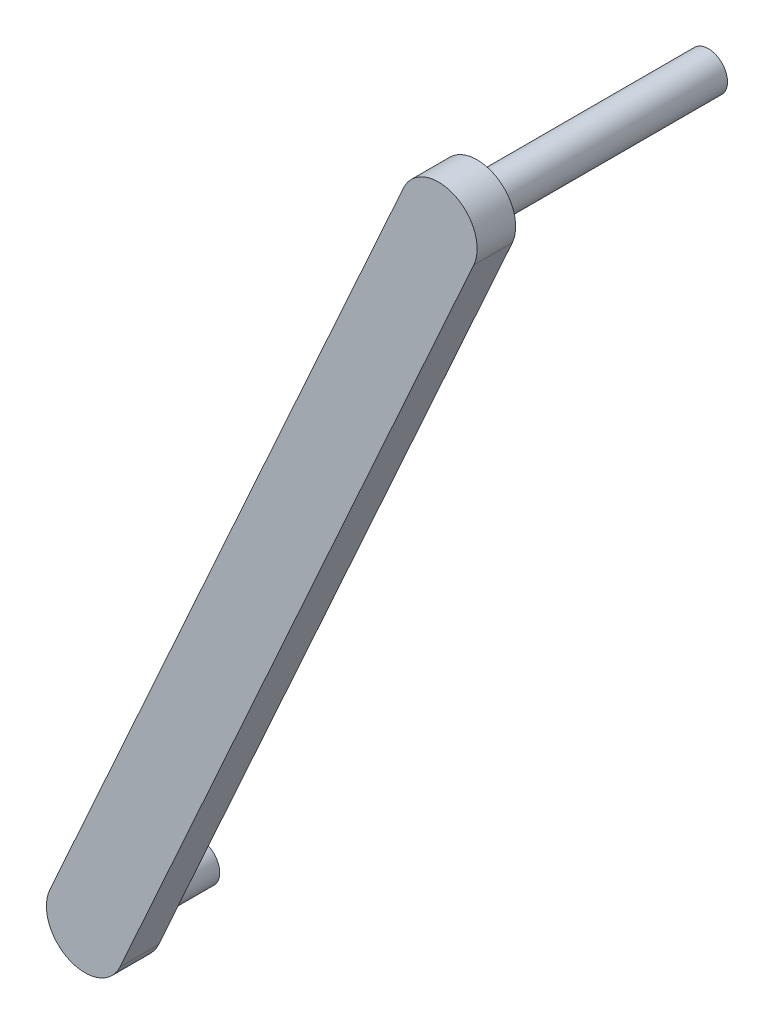
ISO-10303-21;
HEADER;
FILE_DESCRIPTION(('STEP AP214'),'2;1');
FILE_NAME('part.step','',(''),(''),'','','');
FILE_SCHEMA(('AUTOMOTIVE_DESIGN { 1 0 10303 214 1 1 1 1 }'));
ENDSEC;
DATA;
#1=APPLICATION_CONTEXT('core data for automotive mechanical design processes');
#2=APPLICATION_PROTOCOL_DEFINITION('international standard','automotive_design',2000,#1);
#3=PRODUCT_CONTEXT('',#1,'mechanical');
#4=PRODUCT('Part','Part','',(#3));
#5=PRODUCT_RELATED_PRODUCT_CATEGORY('part','',(#4));
#6=PRODUCT_DEFINITION_FORMATION('','',#4);
#7=PRODUCT_DEFINITION_CONTEXT('part definition',#1,'design');
#8=PRODUCT_DEFINITION('design','',#6,#7);
#9=PRODUCT_DEFINITION_SHAPE('','',#8);
#10=(LENGTH_UNIT() NAMED_UNIT(*) SI_UNIT(.MILLI.,.METRE.));
#11=(NAMED_UNIT(*) PLANE_ANGLE_UNIT() SI_UNIT($,.RADIAN.));
#12=(NAMED_UNIT(*) SI_UNIT($,.STERADIAN.) SOLID_ANGLE_UNIT());
#13=UNCERTAINTY_MEASURE_WITH_UNIT(LENGTH_MEASURE(1.E-05),#10,'distance_accuracy_value','');
#14=(GEOMETRIC_REPRESENTATION_CONTEXT(3) GLOBAL_UNCERTAINTY_ASSIGNED_CONTEXT((#13)) GLOBAL_UNIT_ASSIGNED_CONTEXT((#10,
#11,#12)) REPRESENTATION_CONTEXT('',''));
#15=CARTESIAN_POINT('',(0.,0.,0.));
#16=DIRECTION('',(0.,0.,1.));
#17=DIRECTION('',(1.,0.,0.));
#18=AXIS2_PLACEMENT_3D('',#15,#16,#17);
#19=CARTESIAN_POINT('',(0.924716253549064,-18.2644433496141,16.8753490196646));
#20=DIRECTION('',(0.,0.,-1.));
#21=DIRECTION('',(-1.,0.,0.));
#22=AXIS2_PLACEMENT_3D('',#19,#20,#21);
#23=CYLINDRICAL_SURFACE('',#22,2.);
#24=CARTESIAN_POINT('',(0.924716253549064,-18.2644433496141,14.8753490196646));
#25=DIRECTION('',(0.,0.,1.));
#26=DIRECTION('',(1.,0.,0.));
#27=AXIS2_PLACEMENT_3D('',#24,#25,#26);
#28=CIRCLE('',#27,2.);
#29=CARTESIAN_POINT('',(2.74802609914753,-19.0863564879345,14.8753490196646));
#30=VERTEX_POINT('',#29);
#31=CARTESIAN_POINT('',(-0.898593592049403,-17.4425302112937,14.8753490196646));
#32=VERTEX_POINT('',#31);
#33=EDGE_CURVE('E98',#30,#32,#28,.T.);
#34=ORIENTED_EDGE('',*,*,#33,.T.);
#35=DIRECTION('',(0.,0.,-1.));
#36=VECTOR('',#35,1.);
#37=CARTESIAN_POINT('',(-0.898593592049403,-17.4425302112937,16.8753490196646));
#38=LINE('',#37,#36);
#39=CARTESIAN_POINT('',(-0.898593592049403,-17.4425302112937,16.8753490196646));
#40=VERTEX_POINT('',#39);
#41=EDGE_CURVE('E11',#40,#32,#38,.T.);
#42=ORIENTED_EDGE('',*,*,#41,.F.);
#43=CARTESIAN_POINT('',(0.924716253549064,-18.2644433496141,16.8753490196646));
#44=DIRECTION('',(0.,0.,1.));
#45=DIRECTION('',(1.,0.,0.));
#46=AXIS2_PLACEMENT_3D('',#43,#44,#45);
#47=CIRCLE('',#46,2.);
#48=CARTESIAN_POINT('',(2.74802609914753,-19.0863564879345,16.8753490196646));
#49=VERTEX_POINT('',#48);
#50=EDGE_CURVE('E84',#49,#40,#47,.T.);
#51=ORIENTED_EDGE('',*,*,#50,.F.);
#52=DIRECTION('',(0.,0.,-1.));
#53=VECTOR('',#52,1.);
#54=CARTESIAN_POINT('',(2.74802609914753,-19.0863564879345,16.8753490196646));
#55=LINE('',#54,#53);
#56=EDGE_CURVE('E51',#49,#30,#55,.T.);
#57=ORIENTED_EDGE('',*,*,#56,.T.);
#58=EDGE_LOOP('',(#34,#42,#51,#57));
#59=FACE_BOUND('',#58,.T.);
#60=ADVANCED_FACE('F35',(#59),#23,.T.);
#61=CARTESIAN_POINT('',(-0.898593592049403,-17.4425302112937,16.8753490196646));
#62=DIRECTION('',(0.911654922799236,-0.410956569160197,0.));
#63=DIRECTION('',(0.410956569160197,0.911654922799236,0.));
#64=AXIS2_PLACEMENT_3D('',#61,#62,#63);
#65=PLANE('',#64);
#66=DIRECTION('',(-0.410956569160197,-0.911654922799236,0.));
#67=VECTOR('',#66,1.);
#68=CARTESIAN_POINT('',(-0.898593592049403,-17.4425302112937,14.8753490196646));
#69=LINE('',#68,#67);
#70=CARTESIAN_POINT('',(-19.2612829459463,-58.1778229443502,14.8753490196646));
#71=VERTEX_POINT('',#70);
#72=EDGE_CURVE('E89',#32,#71,#69,.T.);
#73=ORIENTED_EDGE('',*,*,#72,.T.);
#74=DIRECTION('',(0.,0.,-1.));
#75=VECTOR('',#74,1.);
#76=CARTESIAN_POINT('',(-19.2612829459463,-58.1778229443502,16.8753490196646));
#77=LINE('',#76,#75);
#78=CARTESIAN_POINT('',(-19.2612829459463,-58.1778229443502,16.8753490196646));
#79=VERTEX_POINT('',#78);
#80=EDGE_CURVE('E43',#79,#71,#77,.T.);
#81=ORIENTED_EDGE('',*,*,#80,.F.);
#82=DIRECTION('',(-0.410956569160197,-0.911654922799236,0.));
#83=VECTOR('',#82,1.);
#84=CARTESIAN_POINT('',(-0.898593592049403,-17.4425302112937,16.8753490196646));
#85=LINE('',#84,#83);
#86=EDGE_CURVE('E77',#40,#79,#85,.T.);
#87=ORIENTED_EDGE('',*,*,#86,.F.);
#88=ORIENTED_EDGE('',*,*,#41,.T.);
#89=EDGE_LOOP('',(#73,#81,#87,#88));
#90=FACE_BOUND('',#89,.T.);
#91=ADVANCED_FACE('F88',(#90),#65,.F.);
#92=CARTESIAN_POINT('',(-17.4379731003478,-58.9997360826706,16.8753490196646));
#93=DIRECTION('',(0.,0.,-1.));
#94=DIRECTION('',(-1.,0.,0.));
#95=AXIS2_PLACEMENT_3D('',#92,#93,#94);
#96=CYLINDRICAL_SURFACE('',#95,2.);
#97=CARTESIAN_POINT('',(-17.4379731003478,-58.9997360826706,14.8753490196646));
#98=DIRECTION('',(0.,0.,1.));
#99=DIRECTION('',(1.,0.,0.));
#100=AXIS2_PLACEMENT_3D('',#97,#98,#99);
#101=CIRCLE('',#100,2.);
#102=CARTESIAN_POINT('',(-15.6146632547493,-59.8216492209909,14.8753490196646));
#103=VERTEX_POINT('',#102);
#104=EDGE_CURVE('E102',#71,#103,#101,.T.);
#105=ORIENTED_EDGE('',*,*,#104,.T.);
#106=DIRECTION('',(0.,0.,-1.));
#107=VECTOR('',#106,1.);
#108=CARTESIAN_POINT('',(-15.6146632547493,-59.8216492209909,16.8753490196646));
#109=LINE('',#108,#107);
#110=CARTESIAN_POINT('',(-15.6146632547493,-59.8216492209909,16.8753490196646));
#111=VERTEX_POINT('',#110);
#112=EDGE_CURVE('E66',#111,#103,#109,.T.);
#113=ORIENTED_EDGE('',*,*,#112,.F.);
#114=CARTESIAN_POINT('',(-17.4379731003478,-58.9997360826706,16.8753490196646));
#115=DIRECTION('',(0.,0.,1.));
#116=DIRECTION('',(1.,0.,0.));
#117=AXIS2_PLACEMENT_3D('',#114,#115,#116);
#118=CIRCLE('',#117,2.);
#119=EDGE_CURVE('E83',#79,#111,#118,.T.);
#120=ORIENTED_EDGE('',*,*,#119,.F.);
#121=ORIENTED_EDGE('',*,*,#80,.T.);
#122=EDGE_LOOP('',(#105,#113,#120,#121));
#123=FACE_BOUND('',#122,.T.);
#124=ADVANCED_FACE('F92',(#123),#96,.T.);
#125=CARTESIAN_POINT('',(2.74802609914753,-19.0863564879345,16.8753490196646));
#126=DIRECTION('',(0.911654922799236,-0.410956569160197,0.));
#127=DIRECTION('',(0.410956569160197,0.911654922799236,0.));
#128=AXIS2_PLACEMENT_3D('',#125,#126,#127);
#129=PLANE('',#128);
#130=DIRECTION('',(-0.410956569160197,-0.911654922799236,0.));
#131=VECTOR('',#130,1.);
#132=CARTESIAN_POINT('',(2.74802609914753,-19.0863564879345,14.8753490196646));
#133=LINE('',#132,#131);
#134=EDGE_CURVE('E104',#30,#103,#133,.T.);
#135=ORIENTED_EDGE('',*,*,#134,.F.);
#136=ORIENTED_EDGE('',*,*,#56,.F.);
#137=DIRECTION('',(-0.410956569160197,-0.911654922799236,0.));
#138=VECTOR('',#137,1.);
#139=CARTESIAN_POINT('',(2.74802609914753,-19.0863564879345,16.8753490196646));
#140=LINE('',#139,#138);
#141=EDGE_CURVE('E93',#49,#111,#140,.T.);
#142=ORIENTED_EDGE('',*,*,#141,.T.);
#143=ORIENTED_EDGE('',*,*,#112,.T.);
#144=EDGE_LOOP('',(#135,#136,#142,#143));
#145=FACE_BOUND('',#144,.T.);
#146=ADVANCED_FACE('F138',(#145),#129,.T.);
#147=CARTESIAN_POINT('',(0.924716253549064,-18.2644433496141,16.8753490196646));
#148=DIRECTION('',(0.,0.,1.));
#149=DIRECTION('',(1.,0.,0.));
#150=AXIS2_PLACEMENT_3D('',#147,#148,#149);
#151=PLANE('',#150);
#152=ORIENTED_EDGE('',*,*,#50,.T.);
#153=ORIENTED_EDGE('',*,*,#86,.T.);
#154=ORIENTED_EDGE('',*,*,#119,.T.);
#155=ORIENTED_EDGE('',*,*,#141,.F.);
#156=EDGE_LOOP('',(#152,#153,#154,#155));
#157=FACE_BOUND('',#156,.T.);
#158=ADVANCED_FACE('F80',(#157),#151,.T.);
#159=CARTESIAN_POINT('',(0.924716253549064,-18.2644433496141,14.8753490196646));
#160=DIRECTION('',(0.,0.,1.));
#161=DIRECTION('',(1.,0.,0.));
#162=AXIS2_PLACEMENT_3D('',#159,#160,#161);
#163=PLANE('',#162);
#164=CARTESIAN_POINT('',(0.924716253549064,-18.2644433496141,14.8753490196646));
#165=DIRECTION('',(0.,0.,1.));
#166=DIRECTION('',(1.,0.,0.));
#167=AXIS2_PLACEMENT_3D('',#164,#165,#166);
#168=CIRCLE('',#167,0.999999999999861);
#169=CARTESIAN_POINT('',(1.92471625354892,-18.2644433496141,14.8753490196646));
#170=VERTEX_POINT('',#169);
#171=EDGE_CURVE('E116',#170,#170,#168,.T.);
#172=ORIENTED_EDGE('',*,*,#171,.T.);
#173=EDGE_LOOP('',(#172));
#174=FACE_BOUND('',#173,.T.);
#175=CARTESIAN_POINT('',(-17.4379731003478,-58.9997360826706,14.8753490196646));
#176=DIRECTION('',(0.,0.,1.));
#177=DIRECTION('',(1.,0.,0.));
#178=AXIS2_PLACEMENT_3D('',#175,#176,#177);
#179=CIRCLE('',#178,0.999999999999998);
#180=CARTESIAN_POINT('',(-16.4379731003478,-58.9997360826706,14.8753490196646));
#181=VERTEX_POINT('',#180);
#182=EDGE_CURVE('E110',#181,#181,#179,.T.);
#183=ORIENTED_EDGE('',*,*,#182,.T.);
#184=EDGE_LOOP('',(#183));
#185=FACE_BOUND('',#184,.T.);
#186=ORIENTED_EDGE('',*,*,#33,.F.);
#187=ORIENTED_EDGE('',*,*,#134,.T.);
#188=ORIENTED_EDGE('',*,*,#104,.F.);
#189=ORIENTED_EDGE('',*,*,#72,.F.);
#190=EDGE_LOOP('',(#186,#187,#188,#189));
#191=FACE_BOUND('',#190,.T.);
#192=ADVANCED_FACE('F137',(#174,#185,#191),#163,.F.);
#193=CARTESIAN_POINT('',(-17.4379731003478,-58.9997360826706,10.8753490196646));
#194=DIRECTION('',(0.,0.,1.));
#195=DIRECTION('',(1.,0.,0.));
#196=AXIS2_PLACEMENT_3D('',#193,#194,#195);
#197=CYLINDRICAL_SURFACE('',#196,0.999999999999998);
#198=CARTESIAN_POINT('',(-17.4379731003478,-58.9997360826706,10.8753490196646));
#199=DIRECTION('',(0.,0.,1.));
#200=DIRECTION('',(1.,0.,0.));
#201=AXIS2_PLACEMENT_3D('',#198,#199,#200);
#202=CIRCLE('',#201,0.999999999999998);
#203=CARTESIAN_POINT('',(-16.4379731003478,-58.9997360826706,10.8753490196646));
#204=VERTEX_POINT('',#203);
#205=EDGE_CURVE('E100',#204,#204,#202,.T.);
#206=ORIENTED_EDGE('',*,*,#205,.T.);
#207=EDGE_LOOP('',(#206));
#208=FACE_BOUND('',#207,.T.);
#209=ORIENTED_EDGE('',*,*,#182,.F.);
#210=EDGE_LOOP('',(#209));
#211=FACE_BOUND('',#210,.T.);
#212=ADVANCED_FACE('F149',(#208,#211),#197,.T.);
#213=CARTESIAN_POINT('',(-17.4379731003478,-58.9997360826706,10.8753490196646));
#214=DIRECTION('',(0.,0.,1.));
#215=DIRECTION('',(1.,0.,0.));
#216=AXIS2_PLACEMENT_3D('',#213,#214,#215);
#217=PLANE('',#216);
#218=ORIENTED_EDGE('',*,*,#205,.F.);
#219=EDGE_LOOP('',(#218));
#220=FACE_BOUND('',#219,.T.);
#221=ADVANCED_FACE('F131',(#220),#217,.F.);
#222=CARTESIAN_POINT('',(0.924716253549064,-18.2644433496141,2.87534901966459));
#223=DIRECTION('',(0.,0.,1.));
#224=DIRECTION('',(1.,0.,0.));
#225=AXIS2_PLACEMENT_3D('',#222,#223,#224);
#226=CYLINDRICAL_SURFACE('',#225,0.999999999999861);
#227=CARTESIAN_POINT('',(0.924716253549064,-18.2644433496141,2.87534901966459));
#228=DIRECTION('',(0.,0.,1.));
#229=DIRECTION('',(1.,0.,0.));
#230=AXIS2_PLACEMENT_3D('',#227,#228,#229);
#231=CIRCLE('',#230,0.999999999999861);
#232=CARTESIAN_POINT('',(1.92471625354892,-18.2644433496141,2.87534901966459));
#233=VERTEX_POINT('',#232);
#234=EDGE_CURVE('E113',#233,#233,#231,.T.);
#235=ORIENTED_EDGE('',*,*,#234,.T.);
#236=EDGE_LOOP('',(#235));
#237=FACE_BOUND('',#236,.T.);
#238=ORIENTED_EDGE('',*,*,#171,.F.);
#239=EDGE_LOOP('',(#238));
#240=FACE_BOUND('',#239,.T.);
#241=ADVANCED_FACE('F122',(#237,#240),#226,.T.);
#242=CARTESIAN_POINT('',(0.,0.,2.87534901966459));
#243=DIRECTION('',(0.,0.,1.));
#244=DIRECTION('',(1.,0.,0.));
#245=AXIS2_PLACEMENT_3D('',#242,#243,#244);
#246=PLANE('',#245);
#247=ORIENTED_EDGE('',*,*,#234,.F.);
#248=EDGE_LOOP('',(#247));
#249=FACE_BOUND('',#248,.T.);
#250=ADVANCED_FACE('F125',(#249),#246,.F.);
#251=CLOSED_SHELL('',(#60,#91,#124,#146,#158,#192,#212,#221,#241,#250));
#252=MANIFOLD_SOLID_BREP('B2',#251);
#253=ADVANCED_BREP_SHAPE_REPRESENTATION('',(#18,#252),#14);
#254=SHAPE_DEFINITION_REPRESENTATION(#9,#253);
ENDSEC;
END-ISO-10303-21;
